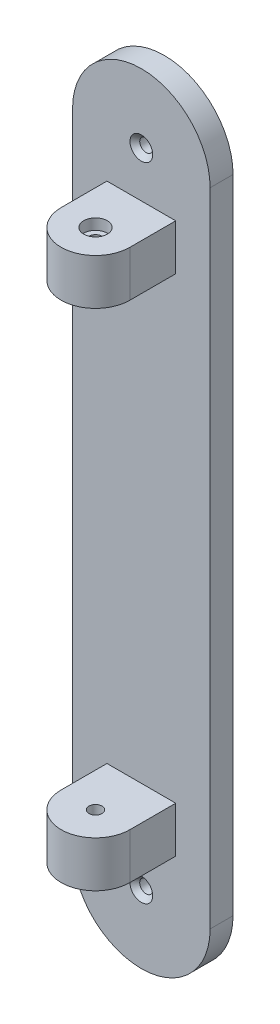
ISO-10303-21;
HEADER;
FILE_DESCRIPTION(('STEP AP214'),'2;1');
FILE_NAME('part.step','',(''),(''),'','','');
FILE_SCHEMA(('AUTOMOTIVE_DESIGN { 1 0 10303 214 1 1 1 1 }'));
ENDSEC;
DATA;
#1=APPLICATION_CONTEXT('core data for automotive mechanical design processes');
#2=APPLICATION_PROTOCOL_DEFINITION('international standard','automotive_design',2000,#1);
#3=PRODUCT_CONTEXT('',#1,'mechanical');
#4=PRODUCT('Part','Part','',(#3));
#5=PRODUCT_RELATED_PRODUCT_CATEGORY('part','',(#4));
#6=PRODUCT_DEFINITION_FORMATION('','',#4);
#7=PRODUCT_DEFINITION_CONTEXT('part definition',#1,'design');
#8=PRODUCT_DEFINITION('design','',#6,#7);
#9=PRODUCT_DEFINITION_SHAPE('','',#8);
#10=(LENGTH_UNIT() NAMED_UNIT(*) SI_UNIT(.MILLI.,.METRE.));
#11=(NAMED_UNIT(*) PLANE_ANGLE_UNIT() SI_UNIT($,.RADIAN.));
#12=(NAMED_UNIT(*) SI_UNIT($,.STERADIAN.) SOLID_ANGLE_UNIT());
#13=UNCERTAINTY_MEASURE_WITH_UNIT(LENGTH_MEASURE(1.E-05),#10,'distance_accuracy_value','');
#14=(GEOMETRIC_REPRESENTATION_CONTEXT(3) GLOBAL_UNCERTAINTY_ASSIGNED_CONTEXT((#13)) GLOBAL_UNIT_ASSIGNED_CONTEXT((#10,
#11,#12)) REPRESENTATION_CONTEXT('',''));
#15=CARTESIAN_POINT('',(0.,0.,0.));
#16=DIRECTION('',(0.,0.,1.));
#17=DIRECTION('',(1.,0.,0.));
#18=AXIS2_PLACEMENT_3D('',#15,#16,#17);
#19=CARTESIAN_POINT('',(28.575,63.5,19.05));
#20=DIRECTION('',(0.,1.,0.));
#21=DIRECTION('',(0.,0.,1.));
#22=AXIS2_PLACEMENT_3D('',#19,#20,#21);
#23=PLANE('',#22);
#24=DIRECTION('',(1.,0.,0.));
#25=VECTOR('',#24,1.);
#26=CARTESIAN_POINT('',(28.575,63.5,6.35));
#27=LINE('',#26,#25);
#28=CARTESIAN_POINT('',(9.52500000000001,63.5,6.35));
#29=VERTEX_POINT('',#28);
#30=CARTESIAN_POINT('',(28.575,63.5,6.35));
#31=VERTEX_POINT('',#30);
#32=EDGE_CURVE('E61',#29,#31,#27,.T.);
#33=ORIENTED_EDGE('',*,*,#32,.T.);
#34=DIRECTION('',(0.,0.,-1.));
#35=VECTOR('',#34,1.);
#36=CARTESIAN_POINT('',(28.575,63.5,19.05));
#37=LINE('',#36,#35);
#38=CARTESIAN_POINT('',(28.575,63.5,19.05));
#39=VERTEX_POINT('',#38);
#40=EDGE_CURVE('E218',#39,#31,#37,.T.);
#41=ORIENTED_EDGE('',*,*,#40,.F.);
#42=CARTESIAN_POINT('',(19.05,63.5,19.05));
#43=DIRECTION('',(0.,1.,0.));
#44=DIRECTION('',(0.,0.,1.));
#45=AXIS2_PLACEMENT_3D('',#42,#43,#44);
#46=CIRCLE('',#45,9.525);
#47=CARTESIAN_POINT('',(9.52500000000001,63.5,19.05));
#48=VERTEX_POINT('',#47);
#49=EDGE_CURVE('E191',#39,#48,#46,.F.);
#50=ORIENTED_EDGE('',*,*,#49,.T.);
#51=DIRECTION('',(0.,0.,-1.));
#52=VECTOR('',#51,1.);
#53=CARTESIAN_POINT('',(9.52500000000001,63.5,19.05));
#54=LINE('',#53,#52);
#55=EDGE_CURVE('E221',#48,#29,#54,.T.);
#56=ORIENTED_EDGE('',*,*,#55,.T.);
#57=EDGE_LOOP('',(#33,#41,#50,#56));
#58=FACE_BOUND('',#57,.T.);
#59=CARTESIAN_POINT('',(19.05,63.5,19.05));
#60=DIRECTION('',(0.,1.,0.));
#61=DIRECTION('',(0.,0.,1.));
#62=AXIS2_PLACEMENT_3D('',#59,#60,#61);
#63=CIRCLE('',#62,1.79999999999999);
#64=CARTESIAN_POINT('',(19.05,63.5,20.85));
#65=VERTEX_POINT('',#64);
#66=EDGE_CURVE('E179',#65,#65,#63,.F.);
#67=ORIENTED_EDGE('',*,*,#66,.F.);
#68=EDGE_LOOP('',(#67));
#69=FACE_BOUND('',#68,.T.);
#70=ADVANCED_FACE('F37',(#58,#69),#23,.F.);
#71=CARTESIAN_POINT('',(19.05,88.9,6.35));
#72=DIRECTION('',(0.,0.,-1.));
#73=DIRECTION('',(-1.,0.,0.));
#74=AXIS2_PLACEMENT_3D('',#71,#72,#73);
#75=PLANE('',#74);
#76=DIRECTION('',(-1.,0.,0.));
#77=VECTOR('',#76,1.);
#78=CARTESIAN_POINT('',(28.575,-76.2,6.35));
#79=LINE('',#78,#77);
#80=CARTESIAN_POINT('',(28.575,-76.2,6.35));
#81=VERTEX_POINT('',#80);
#82=CARTESIAN_POINT('',(9.52500000000001,-76.2,6.35));
#83=VERTEX_POINT('',#82);
#84=EDGE_CURVE('E396',#81,#83,#79,.T.);
#85=ORIENTED_EDGE('',*,*,#84,.T.);
#86=DIRECTION('',(0.,1.,0.));
#87=VECTOR('',#86,1.);
#88=CARTESIAN_POINT('',(9.52500000000001,-76.2,6.35));
#89=LINE('',#88,#87);
#90=CARTESIAN_POINT('',(9.52500000000001,-63.5,6.35));
#91=VERTEX_POINT('',#90);
#92=EDGE_CURVE('E150',#83,#91,#89,.T.);
#93=ORIENTED_EDGE('',*,*,#92,.T.);
#94=DIRECTION('',(1.,0.,0.));
#95=VECTOR('',#94,1.);
#96=CARTESIAN_POINT('',(28.575,-63.5,6.35));
#97=LINE('',#96,#95);
#98=CARTESIAN_POINT('',(28.575,-63.5,6.35));
#99=VERTEX_POINT('',#98);
#100=EDGE_CURVE('E138',#91,#99,#97,.T.);
#101=ORIENTED_EDGE('',*,*,#100,.T.);
#102=DIRECTION('',(0.,-1.,0.));
#103=VECTOR('',#102,1.);
#104=CARTESIAN_POINT('',(28.575,-76.2,6.35));
#105=LINE('',#104,#103);
#106=EDGE_CURVE('E53',#99,#81,#105,.T.);
#107=ORIENTED_EDGE('',*,*,#106,.T.);
#108=EDGE_LOOP('',(#85,#93,#101,#107));
#109=FACE_BOUND('',#108,.T.);
#110=CARTESIAN_POINT('',(19.05,-88.9,6.35));
#111=DIRECTION('',(0.,0.,1.));
#112=DIRECTION('',(1.,0.,0.));
#113=AXIS2_PLACEMENT_3D('',#110,#111,#112);
#114=CIRCLE('',#113,3.15);
#115=CARTESIAN_POINT('',(22.2,-88.9,6.35));
#116=VERTEX_POINT('',#115);
#117=EDGE_CURVE('E152',#116,#116,#114,.T.);
#118=ORIENTED_EDGE('',*,*,#117,.F.);
#119=EDGE_LOOP('',(#118));
#120=FACE_BOUND('',#119,.T.);
#121=DIRECTION('',(0.,-1.,0.));
#122=VECTOR('',#121,1.);
#123=CARTESIAN_POINT('',(0.,0.,6.35));
#124=LINE('',#123,#122);
#125=CARTESIAN_POINT('',(0.,88.9,6.35));
#126=VERTEX_POINT('',#125);
#127=CARTESIAN_POINT('',(0.,-88.9,6.35));
#128=VERTEX_POINT('',#127);
#129=EDGE_CURVE('E233',#126,#128,#124,.T.);
#130=ORIENTED_EDGE('',*,*,#129,.T.);
#131=CARTESIAN_POINT('',(19.05,-88.9,6.35));
#132=DIRECTION('',(0.,0.,-1.));
#133=DIRECTION('',(-1.,0.,0.));
#134=AXIS2_PLACEMENT_3D('',#131,#132,#133);
#135=CIRCLE('',#134,19.05);
#136=CARTESIAN_POINT('',(38.1,-88.9,6.35));
#137=VERTEX_POINT('',#136);
#138=EDGE_CURVE('E167',#137,#128,#135,.T.);
#139=ORIENTED_EDGE('',*,*,#138,.F.);
#140=DIRECTION('',(0.,1.,0.));
#141=VECTOR('',#140,1.);
#142=CARTESIAN_POINT('',(38.1,0.,6.35));
#143=LINE('',#142,#141);
#144=CARTESIAN_POINT('',(38.1,88.9,6.35));
#145=VERTEX_POINT('',#144);
#146=EDGE_CURVE('E235',#137,#145,#143,.T.);
#147=ORIENTED_EDGE('',*,*,#146,.T.);
#148=CARTESIAN_POINT('',(19.05,88.9,6.35));
#149=DIRECTION('',(0.,0.,1.));
#150=DIRECTION('',(-1.,0.,0.));
#151=AXIS2_PLACEMENT_3D('',#148,#149,#150);
#152=CIRCLE('',#151,19.05);
#153=EDGE_CURVE('E238',#145,#126,#152,.T.);
#154=ORIENTED_EDGE('',*,*,#153,.T.);
#155=EDGE_LOOP('',(#130,#139,#147,#154));
#156=FACE_BOUND('',#155,.T.);
#157=CARTESIAN_POINT('',(19.05,88.9,6.35));
#158=DIRECTION('',(0.,0.,1.));
#159=DIRECTION('',(1.,0.,0.));
#160=AXIS2_PLACEMENT_3D('',#157,#158,#159);
#161=CIRCLE('',#160,3.15);
#162=CARTESIAN_POINT('',(22.2,88.9,6.35));
#163=VERTEX_POINT('',#162);
#164=EDGE_CURVE('E223',#163,#163,#161,.T.);
#165=ORIENTED_EDGE('',*,*,#164,.F.);
#166=EDGE_LOOP('',(#165));
#167=FACE_BOUND('',#166,.T.);
#168=DIRECTION('',(0.,-1.,0.));
#169=VECTOR('',#168,1.);
#170=CARTESIAN_POINT('',(9.52500000000001,76.2,6.35));
#171=LINE('',#170,#169);
#172=CARTESIAN_POINT('',(9.52500000000001,76.2,6.35));
#173=VERTEX_POINT('',#172);
#174=EDGE_CURVE('E194',#173,#29,#171,.T.);
#175=ORIENTED_EDGE('',*,*,#174,.F.);
#176=DIRECTION('',(-1.,0.,0.));
#177=VECTOR('',#176,1.);
#178=CARTESIAN_POINT('',(28.575,76.2,6.35));
#179=LINE('',#178,#177);
#180=CARTESIAN_POINT('',(28.575,76.2,6.35));
#181=VERTEX_POINT('',#180);
#182=EDGE_CURVE('E201',#181,#173,#179,.T.);
#183=ORIENTED_EDGE('',*,*,#182,.F.);
#184=DIRECTION('',(0.,1.,0.));
#185=VECTOR('',#184,1.);
#186=CARTESIAN_POINT('',(28.575,76.2,6.35));
#187=LINE('',#186,#185);
#188=EDGE_CURVE('E208',#31,#181,#187,.T.);
#189=ORIENTED_EDGE('',*,*,#188,.F.);
#190=ORIENTED_EDGE('',*,*,#32,.F.);
#191=EDGE_LOOP('',(#175,#183,#189,#190));
#192=FACE_BOUND('',#191,.T.);
#193=ADVANCED_FACE('F261',(#109,#120,#156,#167,#192),#75,.F.);
#194=CARTESIAN_POINT('',(0.,0.,6.35));
#195=DIRECTION('',(1.,0.,0.));
#196=DIRECTION('',(0.,0.,-1.));
#197=AXIS2_PLACEMENT_3D('',#194,#195,#196);
#198=PLANE('',#197);
#199=DIRECTION('',(0.,-1.,0.));
#200=VECTOR('',#199,1.);
#201=CARTESIAN_POINT('',(0.,0.,0.));
#202=LINE('',#201,#200);
#203=CARTESIAN_POINT('',(0.,88.9,0.));
#204=VERTEX_POINT('',#203);
#205=CARTESIAN_POINT('',(0.,-88.9,0.));
#206=VERTEX_POINT('',#205);
#207=EDGE_CURVE('E232',#204,#206,#202,.T.);
#208=ORIENTED_EDGE('',*,*,#207,.T.);
#209=DIRECTION('',(0.,0.,-1.));
#210=VECTOR('',#209,1.);
#211=CARTESIAN_POINT('',(0.,-88.9,6.35));
#212=LINE('',#211,#210);
#213=EDGE_CURVE('E175',#128,#206,#212,.T.);
#214=ORIENTED_EDGE('',*,*,#213,.F.);
#215=ORIENTED_EDGE('',*,*,#129,.F.);
#216=DIRECTION('',(0.,0.,-1.));
#217=VECTOR('',#216,1.);
#218=CARTESIAN_POINT('',(0.,88.9,6.35));
#219=LINE('',#218,#217);
#220=EDGE_CURVE('E46',#126,#204,#219,.T.);
#221=ORIENTED_EDGE('',*,*,#220,.T.);
#222=EDGE_LOOP('',(#208,#214,#215,#221));
#223=FACE_BOUND('',#222,.T.);
#224=ADVANCED_FACE('F39',(#223),#198,.F.);
#225=CARTESIAN_POINT('',(38.1,0.,6.35));
#226=DIRECTION('',(-1.,0.,0.));
#227=DIRECTION('',(0.,0.,1.));
#228=AXIS2_PLACEMENT_3D('',#225,#226,#227);
#229=PLANE('',#228);
#230=DIRECTION('',(0.,1.,0.));
#231=VECTOR('',#230,1.);
#232=CARTESIAN_POINT('',(38.1,0.,0.));
#233=LINE('',#232,#231);
#234=CARTESIAN_POINT('',(38.1,-88.9,0.));
#235=VERTEX_POINT('',#234);
#236=CARTESIAN_POINT('',(38.1,88.9,0.));
#237=VERTEX_POINT('',#236);
#238=EDGE_CURVE('E241',#235,#237,#233,.T.);
#239=ORIENTED_EDGE('',*,*,#238,.T.);
#240=DIRECTION('',(0.,0.,-1.));
#241=VECTOR('',#240,1.);
#242=CARTESIAN_POINT('',(38.1,88.9,6.35));
#243=LINE('',#242,#241);
#244=EDGE_CURVE('E11',#145,#237,#243,.T.);
#245=ORIENTED_EDGE('',*,*,#244,.F.);
#246=ORIENTED_EDGE('',*,*,#146,.F.);
#247=DIRECTION('',(0.,0.,-1.));
#248=VECTOR('',#247,1.);
#249=CARTESIAN_POINT('',(38.1,-88.9,6.35));
#250=LINE('',#249,#248);
#251=EDGE_CURVE('E170',#137,#235,#250,.T.);
#252=ORIENTED_EDGE('',*,*,#251,.T.);
#253=EDGE_LOOP('',(#239,#245,#246,#252));
#254=FACE_BOUND('',#253,.T.);
#255=ADVANCED_FACE('F266',(#254),#229,.F.);
#256=CARTESIAN_POINT('',(19.05,88.9,6.35));
#257=DIRECTION('',(0.,0.,-1.));
#258=DIRECTION('',(-1.,0.,0.));
#259=AXIS2_PLACEMENT_3D('',#256,#257,#258);
#260=CYLINDRICAL_SURFACE('',#259,19.05);
#261=CARTESIAN_POINT('',(19.05,88.9,0.));
#262=DIRECTION('',(0.,0.,1.));
#263=DIRECTION('',(-1.,0.,0.));
#264=AXIS2_PLACEMENT_3D('',#261,#262,#263);
#265=CIRCLE('',#264,19.05);
#266=EDGE_CURVE('E236',#237,#204,#265,.T.);
#267=ORIENTED_EDGE('',*,*,#266,.T.);
#268=ORIENTED_EDGE('',*,*,#220,.F.);
#269=ORIENTED_EDGE('',*,*,#153,.F.);
#270=ORIENTED_EDGE('',*,*,#244,.T.);
#271=EDGE_LOOP('',(#267,#268,#269,#270));
#272=FACE_BOUND('',#271,.T.);
#273=ADVANCED_FACE('F264',(#272),#260,.T.);
#274=CARTESIAN_POINT('',(19.05,88.9,0.));
#275=DIRECTION('',(0.,0.,-1.));
#276=DIRECTION('',(-1.,0.,0.));
#277=AXIS2_PLACEMENT_3D('',#274,#275,#276);
#278=PLANE('',#277);
#279=CARTESIAN_POINT('',(19.05,-88.9,0.));
#280=DIRECTION('',(0.,0.,1.));
#281=DIRECTION('',(1.,0.,0.));
#282=AXIS2_PLACEMENT_3D('',#279,#280,#281);
#283=CIRCLE('',#282,1.8);
#284=CARTESIAN_POINT('',(20.85,-88.9,0.));
#285=VERTEX_POINT('',#284);
#286=EDGE_CURVE('E163',#285,#285,#283,.T.);
#287=ORIENTED_EDGE('',*,*,#286,.T.);
#288=EDGE_LOOP('',(#287));
#289=FACE_BOUND('',#288,.T.);
#290=CARTESIAN_POINT('',(19.05,88.9,0.));
#291=DIRECTION('',(0.,0.,1.));
#292=DIRECTION('',(1.,0.,0.));
#293=AXIS2_PLACEMENT_3D('',#290,#291,#292);
#294=CIRCLE('',#293,1.8);
#295=CARTESIAN_POINT('',(20.85,88.9,0.));
#296=VERTEX_POINT('',#295);
#297=EDGE_CURVE('E229',#296,#296,#294,.T.);
#298=ORIENTED_EDGE('',*,*,#297,.T.);
#299=EDGE_LOOP('',(#298));
#300=FACE_BOUND('',#299,.T.);
#301=ORIENTED_EDGE('',*,*,#207,.F.);
#302=ORIENTED_EDGE('',*,*,#266,.F.);
#303=ORIENTED_EDGE('',*,*,#238,.F.);
#304=CARTESIAN_POINT('',(19.05,-88.9,0.));
#305=DIRECTION('',(0.,0.,-1.));
#306=DIRECTION('',(-1.,0.,0.));
#307=AXIS2_PLACEMENT_3D('',#304,#305,#306);
#308=CIRCLE('',#307,19.05);
#309=EDGE_CURVE('E166',#235,#206,#308,.T.);
#310=ORIENTED_EDGE('',*,*,#309,.T.);
#311=EDGE_LOOP('',(#301,#302,#303,#310));
#312=FACE_BOUND('',#311,.T.);
#313=ADVANCED_FACE('F254',(#289,#300,#312),#278,.T.);
#314=CARTESIAN_POINT('',(19.05,88.9,6.35));
#315=DIRECTION('',(0.,0.,1.));
#316=DIRECTION('',(1.,0.,0.));
#317=AXIS2_PLACEMENT_3D('',#314,#315,#316);
#318=CYLINDRICAL_SURFACE('',#317,1.8);
#319=ORIENTED_EDGE('',*,*,#297,.F.);
#320=EDGE_LOOP('',(#319));
#321=FACE_BOUND('',#320,.T.);
#322=CARTESIAN_POINT('',(19.05,88.9,5.));
#323=DIRECTION('',(0.,0.,1.));
#324=DIRECTION('',(1.,0.,0.));
#325=AXIS2_PLACEMENT_3D('',#322,#323,#324);
#326=CIRCLE('',#325,1.8);
#327=CARTESIAN_POINT('',(20.85,88.9,5.));
#328=VERTEX_POINT('',#327);
#329=EDGE_CURVE('E226',#328,#328,#326,.T.);
#330=ORIENTED_EDGE('',*,*,#329,.T.);
#331=EDGE_LOOP('',(#330));
#332=FACE_BOUND('',#331,.T.);
#333=ADVANCED_FACE('F293',(#321,#332),#318,.F.);
#334=CARTESIAN_POINT('',(19.05,88.9,6.35));
#335=DIRECTION('',(0.,0.,1.));
#336=DIRECTION('',(1.,0.,0.));
#337=AXIS2_PLACEMENT_3D('',#334,#335,#336);
#338=CONICAL_SURFACE('',#337,3.15,0.785398163397448);
#339=ORIENTED_EDGE('',*,*,#329,.F.);
#340=EDGE_LOOP('',(#339));
#341=FACE_BOUND('',#340,.T.);
#342=ORIENTED_EDGE('',*,*,#164,.T.);
#343=EDGE_LOOP('',(#342));
#344=FACE_BOUND('',#343,.T.);
#345=ADVANCED_FACE('F289',(#341,#344),#338,.F.);
#346=CARTESIAN_POINT('',(9.52500000000001,76.2,19.05));
#347=DIRECTION('',(1.,0.,0.));
#348=DIRECTION('',(0.,1.,0.));
#349=AXIS2_PLACEMENT_3D('',#346,#347,#348);
#350=PLANE('',#349);
#351=ORIENTED_EDGE('',*,*,#174,.T.);
#352=ORIENTED_EDGE('',*,*,#55,.F.);
#353=DIRECTION('',(0.,-1.,0.));
#354=VECTOR('',#353,1.);
#355=CARTESIAN_POINT('',(9.52500000000001,76.2,19.05));
#356=LINE('',#355,#354);
#357=CARTESIAN_POINT('',(9.52500000000001,76.2,19.05));
#358=VERTEX_POINT('',#357);
#359=EDGE_CURVE('E197',#358,#48,#356,.T.);
#360=ORIENTED_EDGE('',*,*,#359,.F.);
#361=DIRECTION('',(0.,0.,-1.));
#362=VECTOR('',#361,1.);
#363=CARTESIAN_POINT('',(9.52500000000001,76.2,19.05));
#364=LINE('',#363,#362);
#365=EDGE_CURVE('E204',#358,#173,#364,.T.);
#366=ORIENTED_EDGE('',*,*,#365,.T.);
#367=EDGE_LOOP('',(#351,#352,#360,#366));
#368=FACE_BOUND('',#367,.T.);
#369=ADVANCED_FACE('F286',(#368),#350,.F.);
#370=CARTESIAN_POINT('',(28.575,76.2,19.05));
#371=DIRECTION('',(-1.,0.,0.));
#372=DIRECTION('',(0.,-1.,0.));
#373=AXIS2_PLACEMENT_3D('',#370,#371,#372);
#374=PLANE('',#373);
#375=ORIENTED_EDGE('',*,*,#188,.T.);
#376=DIRECTION('',(0.,0.,-1.));
#377=VECTOR('',#376,1.);
#378=CARTESIAN_POINT('',(28.575,76.2,19.05));
#379=LINE('',#378,#377);
#380=CARTESIAN_POINT('',(28.575,76.2,19.05));
#381=VERTEX_POINT('',#380);
#382=EDGE_CURVE('E215',#381,#181,#379,.T.);
#383=ORIENTED_EDGE('',*,*,#382,.F.);
#384=DIRECTION('',(0.,1.,0.));
#385=VECTOR('',#384,1.);
#386=CARTESIAN_POINT('',(28.575,76.2,19.05));
#387=LINE('',#386,#385);
#388=EDGE_CURVE('E200',#39,#381,#387,.T.);
#389=ORIENTED_EDGE('',*,*,#388,.F.);
#390=ORIENTED_EDGE('',*,*,#40,.T.);
#391=EDGE_LOOP('',(#375,#383,#389,#390));
#392=FACE_BOUND('',#391,.T.);
#393=ADVANCED_FACE('F284',(#392),#374,.F.);
#394=CARTESIAN_POINT('',(28.575,76.2,19.05));
#395=DIRECTION('',(0.,-1.,0.));
#396=DIRECTION('',(0.,0.,-1.));
#397=AXIS2_PLACEMENT_3D('',#394,#395,#396);
#398=PLANE('',#397);
#399=CARTESIAN_POINT('',(19.05,76.2,19.05));
#400=DIRECTION('',(0.,1.,0.));
#401=DIRECTION('',(0.,0.,1.));
#402=AXIS2_PLACEMENT_3D('',#399,#400,#401);
#403=CIRCLE('',#402,3.25);
#404=CARTESIAN_POINT('',(19.05,76.2,22.3));
#405=VERTEX_POINT('',#404);
#406=EDGE_CURVE('E178',#405,#405,#403,.T.);
#407=ORIENTED_EDGE('',*,*,#406,.F.);
#408=EDGE_LOOP('',(#407));
#409=FACE_BOUND('',#408,.T.);
#410=ORIENTED_EDGE('',*,*,#182,.T.);
#411=ORIENTED_EDGE('',*,*,#365,.F.);
#412=CARTESIAN_POINT('',(19.05,76.2,19.05));
#413=DIRECTION('',(0.,1.,0.));
#414=DIRECTION('',(0.,0.,1.));
#415=AXIS2_PLACEMENT_3D('',#412,#413,#414);
#416=CIRCLE('',#415,9.525);
#417=EDGE_CURVE('E182',#358,#381,#416,.T.);
#418=ORIENTED_EDGE('',*,*,#417,.T.);
#419=ORIENTED_EDGE('',*,*,#382,.T.);
#420=EDGE_LOOP('',(#410,#411,#418,#419));
#421=FACE_BOUND('',#420,.T.);
#422=ADVANCED_FACE('F310',(#409,#421),#398,.F.);
#423=CARTESIAN_POINT('',(19.05,42.2014525143145,19.05));
#424=DIRECTION('',(0.,1.,0.));
#425=DIRECTION('',(0.,0.,1.));
#426=AXIS2_PLACEMENT_3D('',#423,#424,#425);
#427=CYLINDRICAL_SURFACE('',#426,9.525);
#428=ORIENTED_EDGE('',*,*,#49,.F.);
#429=ORIENTED_EDGE('',*,*,#388,.T.);
#430=ORIENTED_EDGE('',*,*,#417,.F.);
#431=ORIENTED_EDGE('',*,*,#359,.T.);
#432=EDGE_LOOP('',(#428,#429,#430,#431));
#433=FACE_BOUND('',#432,.T.);
#434=ADVANCED_FACE('F315',(#433),#427,.T.);
#435=CARTESIAN_POINT('',(19.05,76.2,19.05));
#436=DIRECTION('',(0.,1.,0.));
#437=DIRECTION('',(0.,0.,1.));
#438=AXIS2_PLACEMENT_3D('',#435,#436,#437);
#439=CYLINDRICAL_SURFACE('',#438,1.79999999999999);
#440=ORIENTED_EDGE('',*,*,#66,.T.);
#441=EDGE_LOOP('',(#440));
#442=FACE_BOUND('',#441,.T.);
#443=CARTESIAN_POINT('',(19.05,73.2,19.05));
#444=DIRECTION('',(0.,1.,0.));
#445=DIRECTION('',(0.,0.,1.));
#446=AXIS2_PLACEMENT_3D('',#443,#444,#445);
#447=CIRCLE('',#446,1.79999999999999);
#448=CARTESIAN_POINT('',(19.05,73.2,20.85));
#449=VERTEX_POINT('',#448);
#450=EDGE_CURVE('E183',#449,#449,#447,.T.);
#451=ORIENTED_EDGE('',*,*,#450,.T.);
#452=EDGE_LOOP('',(#451));
#453=FACE_BOUND('',#452,.T.);
#454=ADVANCED_FACE('F326',(#442,#453),#439,.F.);
#455=CARTESIAN_POINT('',(20.85,73.2,19.05));
#456=DIRECTION('',(0.,-1.,0.));
#457=DIRECTION('',(0.,0.,-1.));
#458=AXIS2_PLACEMENT_3D('',#455,#456,#457);
#459=PLANE('',#458);
#460=ORIENTED_EDGE('',*,*,#450,.F.);
#461=EDGE_LOOP('',(#460));
#462=FACE_BOUND('',#461,.T.);
#463=CARTESIAN_POINT('',(19.05,73.2,19.05));
#464=DIRECTION('',(0.,1.,0.));
#465=DIRECTION('',(0.,0.,1.));
#466=AXIS2_PLACEMENT_3D('',#463,#464,#465);
#467=CIRCLE('',#466,3.25);
#468=CARTESIAN_POINT('',(19.05,73.2,22.3));
#469=VERTEX_POINT('',#468);
#470=EDGE_CURVE('E186',#469,#469,#467,.T.);
#471=ORIENTED_EDGE('',*,*,#470,.T.);
#472=EDGE_LOOP('',(#471));
#473=FACE_BOUND('',#472,.T.);
#474=ADVANCED_FACE('F332',(#462,#473),#459,.F.);
#475=CARTESIAN_POINT('',(19.05,76.2,19.05));
#476=DIRECTION('',(0.,1.,0.));
#477=DIRECTION('',(0.,0.,1.));
#478=AXIS2_PLACEMENT_3D('',#475,#476,#477);
#479=CYLINDRICAL_SURFACE('',#478,3.25);
#480=ORIENTED_EDGE('',*,*,#470,.F.);
#481=EDGE_LOOP('',(#480));
#482=FACE_BOUND('',#481,.T.);
#483=ORIENTED_EDGE('',*,*,#406,.T.);
#484=EDGE_LOOP('',(#483));
#485=FACE_BOUND('',#484,.T.);
#486=ADVANCED_FACE('F336',(#482,#485),#479,.F.);
#487=CARTESIAN_POINT('',(19.05,-88.9,6.35));
#488=DIRECTION('',(0.,0.,-1.));
#489=DIRECTION('',(-1.,0.,0.));
#490=AXIS2_PLACEMENT_3D('',#487,#488,#489);
#491=CYLINDRICAL_SURFACE('',#490,19.05);
#492=ORIENTED_EDGE('',*,*,#309,.F.);
#493=ORIENTED_EDGE('',*,*,#251,.F.);
#494=ORIENTED_EDGE('',*,*,#138,.T.);
#495=ORIENTED_EDGE('',*,*,#213,.T.);
#496=EDGE_LOOP('',(#492,#493,#494,#495));
#497=FACE_BOUND('',#496,.T.);
#498=ADVANCED_FACE('F258',(#497),#491,.T.);
#499=CARTESIAN_POINT('',(19.05,-88.9,6.35));
#500=DIRECTION('',(0.,0.,1.));
#501=DIRECTION('',(1.,0.,0.));
#502=AXIS2_PLACEMENT_3D('',#499,#500,#501);
#503=CYLINDRICAL_SURFACE('',#502,1.8);
#504=ORIENTED_EDGE('',*,*,#286,.F.);
#505=EDGE_LOOP('',(#504));
#506=FACE_BOUND('',#505,.T.);
#507=CARTESIAN_POINT('',(19.05,-88.9,5.));
#508=DIRECTION('',(0.,0.,1.));
#509=DIRECTION('',(1.,0.,0.));
#510=AXIS2_PLACEMENT_3D('',#507,#508,#509);
#511=CIRCLE('',#510,1.8);
#512=CARTESIAN_POINT('',(20.85,-88.9,5.));
#513=VERTEX_POINT('',#512);
#514=EDGE_CURVE('E155',#513,#513,#511,.T.);
#515=ORIENTED_EDGE('',*,*,#514,.T.);
#516=EDGE_LOOP('',(#515));
#517=FACE_BOUND('',#516,.T.);
#518=ADVANCED_FACE('F343',(#506,#517),#503,.F.);
#519=CARTESIAN_POINT('',(19.05,-88.9,6.35));
#520=DIRECTION('',(0.,0.,1.));
#521=DIRECTION('',(1.,0.,0.));
#522=AXIS2_PLACEMENT_3D('',#519,#520,#521);
#523=CONICAL_SURFACE('',#522,3.15,0.785398163397448);
#524=ORIENTED_EDGE('',*,*,#514,.F.);
#525=EDGE_LOOP('',(#524));
#526=FACE_BOUND('',#525,.T.);
#527=ORIENTED_EDGE('',*,*,#117,.T.);
#528=EDGE_LOOP('',(#527));
#529=FACE_BOUND('',#528,.T.);
#530=ADVANCED_FACE('F346',(#526,#529),#523,.F.);
#531=CARTESIAN_POINT('',(9.52500000000001,-76.2,19.05));
#532=DIRECTION('',(-1.,0.,0.));
#533=DIRECTION('',(0.,-1.,0.));
#534=AXIS2_PLACEMENT_3D('',#531,#532,#533);
#535=PLANE('',#534);
#536=ORIENTED_EDGE('',*,*,#92,.F.);
#537=DIRECTION('',(0.,0.,-1.));
#538=VECTOR('',#537,1.);
#539=CARTESIAN_POINT('',(9.52500000000001,-76.2,19.05));
#540=LINE('',#539,#538);
#541=CARTESIAN_POINT('',(9.52500000000001,-76.2,19.05));
#542=VERTEX_POINT('',#541);
#543=EDGE_CURVE('E143',#542,#83,#540,.T.);
#544=ORIENTED_EDGE('',*,*,#543,.F.);
#545=DIRECTION('',(0.,1.,0.));
#546=VECTOR('',#545,1.);
#547=CARTESIAN_POINT('',(9.52500000000001,-76.2,19.05));
#548=LINE('',#547,#546);
#549=CARTESIAN_POINT('',(9.52500000000001,-63.5,19.05));
#550=VERTEX_POINT('',#549);
#551=EDGE_CURVE('E127',#542,#550,#548,.T.);
#552=ORIENTED_EDGE('',*,*,#551,.T.);
#553=DIRECTION('',(0.,0.,-1.));
#554=VECTOR('',#553,1.);
#555=CARTESIAN_POINT('',(9.52500000000001,-63.5,19.05));
#556=LINE('',#555,#554);
#557=EDGE_CURVE('E394',#550,#91,#556,.T.);
#558=ORIENTED_EDGE('',*,*,#557,.T.);
#559=EDGE_LOOP('',(#536,#544,#552,#558));
#560=FACE_BOUND('',#559,.T.);
#561=ADVANCED_FACE('F148',(#560),#535,.T.);
#562=CARTESIAN_POINT('',(28.575,-76.2,19.05));
#563=DIRECTION('',(0.,-1.,0.));
#564=DIRECTION('',(0.,0.,-1.));
#565=AXIS2_PLACEMENT_3D('',#562,#563,#564);
#566=PLANE('',#565);
#567=CARTESIAN_POINT('',(19.05,-76.2,19.05));
#568=DIRECTION('',(0.,-1.,0.));
#569=DIRECTION('',(0.,0.,-1.));
#570=AXIS2_PLACEMENT_3D('',#567,#568,#569);
#571=CIRCLE('',#570,3.25);
#572=CARTESIAN_POINT('',(19.05,-76.2,15.8));
#573=VERTEX_POINT('',#572);
#574=EDGE_CURVE('E385',#573,#573,#571,.T.);
#575=ORIENTED_EDGE('',*,*,#574,.F.);
#576=EDGE_LOOP('',(#575));
#577=FACE_BOUND('',#576,.T.);
#578=ORIENTED_EDGE('',*,*,#84,.F.);
#579=DIRECTION('',(0.,0.,-1.));
#580=VECTOR('',#579,1.);
#581=CARTESIAN_POINT('',(28.575,-76.2,19.05));
#582=LINE('',#581,#580);
#583=CARTESIAN_POINT('',(28.575,-76.2,19.05));
#584=VERTEX_POINT('',#583);
#585=EDGE_CURVE('E145',#584,#81,#582,.T.);
#586=ORIENTED_EDGE('',*,*,#585,.F.);
#587=CARTESIAN_POINT('',(19.05,-76.2,19.05));
#588=DIRECTION('',(0.,1.,0.));
#589=DIRECTION('',(0.,0.,1.));
#590=AXIS2_PLACEMENT_3D('',#587,#588,#589);
#591=CIRCLE('',#590,9.525);
#592=EDGE_CURVE('E130',#542,#584,#591,.T.);
#593=ORIENTED_EDGE('',*,*,#592,.F.);
#594=ORIENTED_EDGE('',*,*,#543,.T.);
#595=EDGE_LOOP('',(#578,#586,#593,#594));
#596=FACE_BOUND('',#595,.T.);
#597=ADVANCED_FACE('F142',(#577,#596),#566,.T.);
#598=CARTESIAN_POINT('',(28.575,-76.2,19.05));
#599=DIRECTION('',(1.,0.,0.));
#600=DIRECTION('',(0.,1.,0.));
#601=AXIS2_PLACEMENT_3D('',#598,#599,#600);
#602=PLANE('',#601);
#603=ORIENTED_EDGE('',*,*,#106,.F.);
#604=DIRECTION('',(0.,0.,-1.));
#605=VECTOR('',#604,1.);
#606=CARTESIAN_POINT('',(28.575,-63.5,19.05));
#607=LINE('',#606,#605);
#608=CARTESIAN_POINT('',(28.575,-63.5,19.05));
#609=VERTEX_POINT('',#608);
#610=EDGE_CURVE('E157',#609,#99,#607,.T.);
#611=ORIENTED_EDGE('',*,*,#610,.F.);
#612=DIRECTION('',(0.,-1.,0.));
#613=VECTOR('',#612,1.);
#614=CARTESIAN_POINT('',(28.575,-76.2,19.05));
#615=LINE('',#614,#613);
#616=EDGE_CURVE('E137',#609,#584,#615,.T.);
#617=ORIENTED_EDGE('',*,*,#616,.T.);
#618=ORIENTED_EDGE('',*,*,#585,.T.);
#619=EDGE_LOOP('',(#603,#611,#617,#618));
#620=FACE_BOUND('',#619,.T.);
#621=ADVANCED_FACE('F355',(#620),#602,.T.);
#622=CARTESIAN_POINT('',(28.575,-63.5,19.05));
#623=DIRECTION('',(0.,1.,0.));
#624=DIRECTION('',(0.,0.,1.));
#625=AXIS2_PLACEMENT_3D('',#622,#623,#624);
#626=PLANE('',#625);
#627=CARTESIAN_POINT('',(19.05,-63.5,19.05));
#628=DIRECTION('',(0.,1.,0.));
#629=DIRECTION('',(0.,0.,1.));
#630=AXIS2_PLACEMENT_3D('',#627,#628,#629);
#631=CIRCLE('',#630,1.79999999999998);
#632=CARTESIAN_POINT('',(19.05,-63.5,20.85));
#633=VERTEX_POINT('',#632);
#634=EDGE_CURVE('E41',#633,#633,#631,.T.);
#635=ORIENTED_EDGE('',*,*,#634,.F.);
#636=EDGE_LOOP('',(#635));
#637=FACE_BOUND('',#636,.T.);
#638=ORIENTED_EDGE('',*,*,#100,.F.);
#639=ORIENTED_EDGE('',*,*,#557,.F.);
#640=CARTESIAN_POINT('',(19.05,-63.5,19.05));
#641=DIRECTION('',(0.,-1.,0.));
#642=DIRECTION('',(0.,0.,-1.));
#643=AXIS2_PLACEMENT_3D('',#640,#641,#642);
#644=CIRCLE('',#643,9.525);
#645=EDGE_CURVE('E133',#609,#550,#644,.T.);
#646=ORIENTED_EDGE('',*,*,#645,.F.);
#647=ORIENTED_EDGE('',*,*,#610,.T.);
#648=EDGE_LOOP('',(#638,#639,#646,#647));
#649=FACE_BOUND('',#648,.T.);
#650=ADVANCED_FACE('F359',(#637,#649),#626,.T.);
#651=CARTESIAN_POINT('',(19.05,84.7985474856855,19.05));
#652=DIRECTION('',(0.,-1.,0.));
#653=DIRECTION('',(0.,0.,-1.));
#654=AXIS2_PLACEMENT_3D('',#651,#652,#653);
#655=CYLINDRICAL_SURFACE('',#654,9.525);
#656=ORIENTED_EDGE('',*,*,#616,.F.);
#657=ORIENTED_EDGE('',*,*,#645,.T.);
#658=ORIENTED_EDGE('',*,*,#551,.F.);
#659=ORIENTED_EDGE('',*,*,#592,.T.);
#660=EDGE_LOOP('',(#656,#657,#658,#659));
#661=FACE_BOUND('',#660,.T.);
#662=ADVANCED_FACE('F129',(#661),#655,.T.);
#663=CARTESIAN_POINT('',(19.05,-76.2,19.05));
#664=DIRECTION('',(0.,-1.,0.));
#665=DIRECTION('',(0.,0.,-1.));
#666=AXIS2_PLACEMENT_3D('',#663,#664,#665);
#667=CYLINDRICAL_SURFACE('',#666,1.79999999999998);
#668=ORIENTED_EDGE('',*,*,#634,.T.);
#669=EDGE_LOOP('',(#668));
#670=FACE_BOUND('',#669,.T.);
#671=CARTESIAN_POINT('',(19.05,-73.2,19.05));
#672=DIRECTION('',(0.,-1.,0.));
#673=DIRECTION('',(0.,0.,-1.));
#674=AXIS2_PLACEMENT_3D('',#671,#672,#673);
#675=CIRCLE('',#674,1.79999999999999);
#676=CARTESIAN_POINT('',(19.05,-73.2,17.25));
#677=VERTEX_POINT('',#676);
#678=EDGE_CURVE('E383',#677,#677,#675,.T.);
#679=ORIENTED_EDGE('',*,*,#678,.T.);
#680=EDGE_LOOP('',(#679));
#681=FACE_BOUND('',#680,.T.);
#682=ADVANCED_FACE('F365',(#670,#681),#667,.F.);
#683=CARTESIAN_POINT('',(20.85,-73.2,19.05));
#684=DIRECTION('',(0.,1.,0.));
#685=DIRECTION('',(0.,0.,1.));
#686=AXIS2_PLACEMENT_3D('',#683,#684,#685);
#687=PLANE('',#686);
#688=ORIENTED_EDGE('',*,*,#678,.F.);
#689=EDGE_LOOP('',(#688));
#690=FACE_BOUND('',#689,.T.);
#691=CARTESIAN_POINT('',(19.05,-73.2,19.05));
#692=DIRECTION('',(0.,-1.,0.));
#693=DIRECTION('',(0.,0.,-1.));
#694=AXIS2_PLACEMENT_3D('',#691,#692,#693);
#695=CIRCLE('',#694,3.25);
#696=CARTESIAN_POINT('',(19.05,-73.2,15.8));
#697=VERTEX_POINT('',#696);
#698=EDGE_CURVE('E384',#697,#697,#695,.T.);
#699=ORIENTED_EDGE('',*,*,#698,.T.);
#700=EDGE_LOOP('',(#699));
#701=FACE_BOUND('',#700,.T.);
#702=ADVANCED_FACE('F369',(#690,#701),#687,.F.);
#703=CARTESIAN_POINT('',(19.05,-76.2,19.05));
#704=DIRECTION('',(0.,-1.,0.));
#705=DIRECTION('',(0.,0.,-1.));
#706=AXIS2_PLACEMENT_3D('',#703,#704,#705);
#707=CYLINDRICAL_SURFACE('',#706,3.25);
#708=ORIENTED_EDGE('',*,*,#698,.F.);
#709=EDGE_LOOP('',(#708));
#710=FACE_BOUND('',#709,.T.);
#711=ORIENTED_EDGE('',*,*,#574,.T.);
#712=EDGE_LOOP('',(#711));
#713=FACE_BOUND('',#712,.T.);
#714=ADVANCED_FACE('F366',(#710,#713),#707,.F.);
#715=CLOSED_SHELL('',(#70,#193,#224,#255,#273,#313,#333,#345,#369,#393,#422,#434,#454,#474,#486,
#498,#518,#530,#561,#597,#621,#650,#662,#682,#702,#714));
#716=MANIFOLD_SOLID_BREP('B2',#715);
#717=ADVANCED_BREP_SHAPE_REPRESENTATION('',(#18,#716),#14);
#718=SHAPE_DEFINITION_REPRESENTATION(#9,#717);
ENDSEC;
END-ISO-10303-21;
